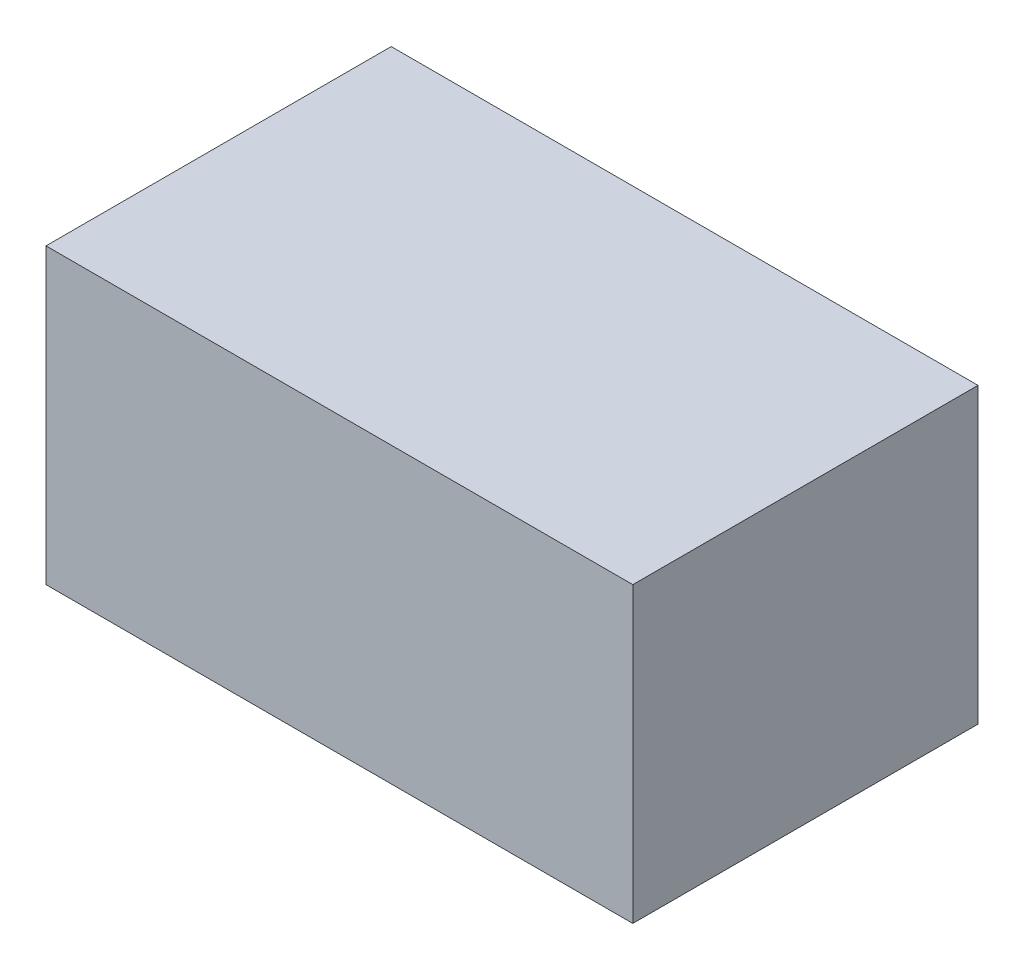
ISO-10303-21;
HEADER;
FILE_DESCRIPTION(('STEP AP214'),'2;1');
FILE_NAME('part.step','',(''),(''),'','','');
FILE_SCHEMA(('AUTOMOTIVE_DESIGN { 1 0 10303 214 1 1 1 1 }'));
ENDSEC;
DATA;
#1=APPLICATION_CONTEXT('core data for automotive mechanical design processes');
#2=APPLICATION_PROTOCOL_DEFINITION('international standard','automotive_design',2000,#1);
#3=PRODUCT_CONTEXT('',#1,'mechanical');
#4=PRODUCT('Part','Part','',(#3));
#5=PRODUCT_RELATED_PRODUCT_CATEGORY('part','',(#4));
#6=PRODUCT_DEFINITION_FORMATION('','',#4);
#7=PRODUCT_DEFINITION_CONTEXT('part definition',#1,'design');
#8=PRODUCT_DEFINITION('design','',#6,#7);
#9=PRODUCT_DEFINITION_SHAPE('','',#8);
#10=(LENGTH_UNIT() NAMED_UNIT(*) SI_UNIT(.MILLI.,.METRE.));
#11=(NAMED_UNIT(*) PLANE_ANGLE_UNIT() SI_UNIT($,.RADIAN.));
#12=(NAMED_UNIT(*) SI_UNIT($,.STERADIAN.) SOLID_ANGLE_UNIT());
#13=UNCERTAINTY_MEASURE_WITH_UNIT(LENGTH_MEASURE(1.E-05),#10,'distance_accuracy_value','');
#14=(GEOMETRIC_REPRESENTATION_CONTEXT(3) GLOBAL_UNCERTAINTY_ASSIGNED_CONTEXT((#13)) GLOBAL_UNIT_ASSIGNED_CONTEXT((#10,
#11,#12)) REPRESENTATION_CONTEXT('',''));
#15=CARTESIAN_POINT('',(0.,0.,0.));
#16=DIRECTION('',(0.,0.,1.));
#17=DIRECTION('',(1.,0.,0.));
#18=AXIS2_PLACEMENT_3D('',#15,#16,#17);
#19=CARTESIAN_POINT('',(0.17,0.17,0.1));
#20=DIRECTION('',(-1.,0.,0.));
#21=DIRECTION('',(0.,0.,1.));
#22=AXIS2_PLACEMENT_3D('',#19,#20,#21);
#23=PLANE('',#22);
#24=DIRECTION('',(0.,0.,-1.));
#25=VECTOR('',#24,1.);
#26=CARTESIAN_POINT('',(0.17,0.,0.1));
#27=LINE('',#26,#25);
#28=CARTESIAN_POINT('',(0.17,0.,0.1));
#29=VERTEX_POINT('',#28);
#30=CARTESIAN_POINT('',(0.17,0.,-0.1));
#31=VERTEX_POINT('',#30);
#32=EDGE_CURVE('E107',#29,#31,#27,.T.);
#33=ORIENTED_EDGE('',*,*,#32,.T.);
#34=DIRECTION('',(0.,-1.,0.));
#35=VECTOR('',#34,1.);
#36=CARTESIAN_POINT('',(0.17,0.17,-0.1));
#37=LINE('',#36,#35);
#38=CARTESIAN_POINT('',(0.17,0.17,-0.1));
#39=VERTEX_POINT('',#38);
#40=EDGE_CURVE('E11',#39,#31,#37,.T.);
#41=ORIENTED_EDGE('',*,*,#40,.F.);
#42=DIRECTION('',(0.,0.,-1.));
#43=VECTOR('',#42,1.);
#44=CARTESIAN_POINT('',(0.17,0.17,0.1));
#45=LINE('',#44,#43);
#46=CARTESIAN_POINT('',(0.17,0.17,0.1));
#47=VERTEX_POINT('',#46);
#48=EDGE_CURVE('E91',#47,#39,#45,.T.);
#49=ORIENTED_EDGE('',*,*,#48,.F.);
#50=DIRECTION('',(0.,-1.,0.));
#51=VECTOR('',#50,1.);
#52=CARTESIAN_POINT('',(0.17,0.17,0.1));
#53=LINE('',#52,#51);
#54=EDGE_CURVE('E103',#47,#29,#53,.T.);
#55=ORIENTED_EDGE('',*,*,#54,.T.);
#56=EDGE_LOOP('',(#33,#41,#49,#55));
#57=FACE_BOUND('',#56,.T.);
#58=ADVANCED_FACE('F39',(#57),#23,.F.);
#59=CARTESIAN_POINT('',(-0.17,0.17,-0.1));
#60=DIRECTION('',(0.,0.,1.));
#61=DIRECTION('',(1.,0.,0.));
#62=AXIS2_PLACEMENT_3D('',#59,#60,#61);
#63=PLANE('',#62);
#64=DIRECTION('',(-1.,0.,0.));
#65=VECTOR('',#64,1.);
#66=CARTESIAN_POINT('',(-0.17,0.,-0.1));
#67=LINE('',#66,#65);
#68=CARTESIAN_POINT('',(-0.17,0.,-0.1));
#69=VERTEX_POINT('',#68);
#70=EDGE_CURVE('E96',#31,#69,#67,.T.);
#71=ORIENTED_EDGE('',*,*,#70,.T.);
#72=DIRECTION('',(0.,-1.,0.));
#73=VECTOR('',#72,1.);
#74=CARTESIAN_POINT('',(-0.17,0.17,-0.1));
#75=LINE('',#74,#73);
#76=CARTESIAN_POINT('',(-0.17,0.17,-0.1));
#77=VERTEX_POINT('',#76);
#78=EDGE_CURVE('E48',#77,#69,#75,.T.);
#79=ORIENTED_EDGE('',*,*,#78,.F.);
#80=DIRECTION('',(-1.,0.,0.));
#81=VECTOR('',#80,1.);
#82=CARTESIAN_POINT('',(-0.17,0.17,-0.1));
#83=LINE('',#82,#81);
#84=EDGE_CURVE('E86',#39,#77,#83,.T.);
#85=ORIENTED_EDGE('',*,*,#84,.F.);
#86=ORIENTED_EDGE('',*,*,#40,.T.);
#87=EDGE_LOOP('',(#71,#79,#85,#86));
#88=FACE_BOUND('',#87,.T.);
#89=ADVANCED_FACE('F95',(#88),#63,.F.);
#90=CARTESIAN_POINT('',(-0.17,0.17,0.1));
#91=DIRECTION('',(1.,0.,0.));
#92=DIRECTION('',(0.,0.,-1.));
#93=AXIS2_PLACEMENT_3D('',#90,#91,#92);
#94=PLANE('',#93);
#95=DIRECTION('',(0.,0.,1.));
#96=VECTOR('',#95,1.);
#97=CARTESIAN_POINT('',(-0.17,0.,0.1));
#98=LINE('',#97,#96);
#99=CARTESIAN_POINT('',(-0.17,0.,0.1));
#100=VERTEX_POINT('',#99);
#101=EDGE_CURVE('E73',#69,#100,#98,.T.);
#102=ORIENTED_EDGE('',*,*,#101,.T.);
#103=DIRECTION('',(0.,-1.,0.));
#104=VECTOR('',#103,1.);
#105=CARTESIAN_POINT('',(-0.17,0.17,0.1));
#106=LINE('',#105,#104);
#107=CARTESIAN_POINT('',(-0.17,0.17,0.1));
#108=VERTEX_POINT('',#107);
#109=EDGE_CURVE('E98',#108,#100,#106,.T.);
#110=ORIENTED_EDGE('',*,*,#109,.F.);
#111=DIRECTION('',(0.,0.,1.));
#112=VECTOR('',#111,1.);
#113=CARTESIAN_POINT('',(-0.17,0.17,0.1));
#114=LINE('',#113,#112);
#115=EDGE_CURVE('E89',#77,#108,#114,.T.);
#116=ORIENTED_EDGE('',*,*,#115,.F.);
#117=ORIENTED_EDGE('',*,*,#78,.T.);
#118=EDGE_LOOP('',(#102,#110,#116,#117));
#119=FACE_BOUND('',#118,.T.);
#120=ADVANCED_FACE('F99',(#119),#94,.F.);
#121=CARTESIAN_POINT('',(-0.17,0.17,0.1));
#122=DIRECTION('',(0.,0.,-1.));
#123=DIRECTION('',(-1.,0.,0.));
#124=AXIS2_PLACEMENT_3D('',#121,#122,#123);
#125=PLANE('',#124);
#126=DIRECTION('',(1.,0.,0.));
#127=VECTOR('',#126,1.);
#128=CARTESIAN_POINT('',(-0.17,0.,0.1));
#129=LINE('',#128,#127);
#130=EDGE_CURVE('E79',#100,#29,#129,.T.);
#131=ORIENTED_EDGE('',*,*,#130,.T.);
#132=ORIENTED_EDGE('',*,*,#54,.F.);
#133=DIRECTION('',(1.,0.,0.));
#134=VECTOR('',#133,1.);
#135=CARTESIAN_POINT('',(-0.17,0.17,0.1));
#136=LINE('',#135,#134);
#137=EDGE_CURVE('E56',#108,#47,#136,.T.);
#138=ORIENTED_EDGE('',*,*,#137,.F.);
#139=ORIENTED_EDGE('',*,*,#109,.T.);
#140=EDGE_LOOP('',(#131,#132,#138,#139));
#141=FACE_BOUND('',#140,.T.);
#142=ADVANCED_FACE('F120',(#141),#125,.F.);
#143=CARTESIAN_POINT('',(0.,0.17,0.));
#144=DIRECTION('',(0.,-1.,0.));
#145=DIRECTION('',(0.,0.,-1.));
#146=AXIS2_PLACEMENT_3D('',#143,#144,#145);
#147=PLANE('',#146);
#148=ORIENTED_EDGE('',*,*,#48,.T.);
#149=ORIENTED_EDGE('',*,*,#84,.T.);
#150=ORIENTED_EDGE('',*,*,#115,.T.);
#151=ORIENTED_EDGE('',*,*,#137,.T.);
#152=EDGE_LOOP('',(#148,#149,#150,#151));
#153=FACE_BOUND('',#152,.T.);
#154=ADVANCED_FACE('F87',(#153),#147,.F.);
#155=CARTESIAN_POINT('',(0.,0.,0.));
#156=DIRECTION('',(0.,-1.,0.));
#157=DIRECTION('',(0.,0.,-1.));
#158=AXIS2_PLACEMENT_3D('',#155,#156,#157);
#159=PLANE('',#158);
#160=ORIENTED_EDGE('',*,*,#32,.F.);
#161=ORIENTED_EDGE('',*,*,#130,.F.);
#162=ORIENTED_EDGE('',*,*,#101,.F.);
#163=ORIENTED_EDGE('',*,*,#70,.F.);
#164=EDGE_LOOP('',(#160,#161,#162,#163));
#165=FACE_BOUND('',#164,.T.);
#166=ADVANCED_FACE('F123',(#165),#159,.T.);
#167=CLOSED_SHELL('',(#58,#89,#120,#142,#154,#166));
#168=MANIFOLD_SOLID_BREP('B2',#167);
#169=ADVANCED_BREP_SHAPE_REPRESENTATION('',(#18,#168),#14);
#170=SHAPE_DEFINITION_REPRESENTATION(#9,#169);
ENDSEC;
END-ISO-10303-21;
